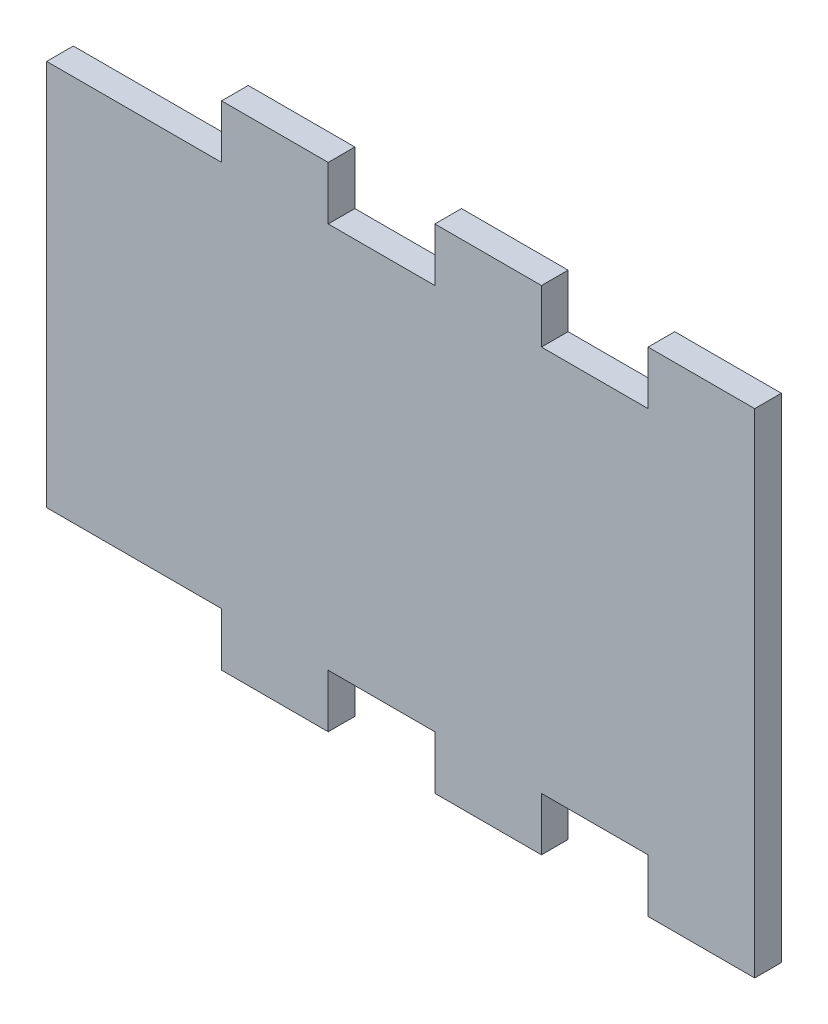
ISO-10303-21;
HEADER;
FILE_DESCRIPTION(('STEP AP214'),'2;1');
FILE_NAME('part.step','',(''),(''),'','','');
FILE_SCHEMA(('AUTOMOTIVE_DESIGN { 1 0 10303 214 1 1 1 1 }'));
ENDSEC;
DATA;
#1=APPLICATION_CONTEXT('core data for automotive mechanical design processes');
#2=APPLICATION_PROTOCOL_DEFINITION('international standard','automotive_design',2000,#1);
#3=PRODUCT_CONTEXT('',#1,'mechanical');
#4=PRODUCT('Part','Part','',(#3));
#5=PRODUCT_RELATED_PRODUCT_CATEGORY('part','',(#4));
#6=PRODUCT_DEFINITION_FORMATION('','',#4);
#7=PRODUCT_DEFINITION_CONTEXT('part definition',#1,'design');
#8=PRODUCT_DEFINITION('design','',#6,#7);
#9=PRODUCT_DEFINITION_SHAPE('','',#8);
#10=(LENGTH_UNIT() NAMED_UNIT(*) SI_UNIT(.MILLI.,.METRE.));
#11=(NAMED_UNIT(*) PLANE_ANGLE_UNIT() SI_UNIT($,.RADIAN.));
#12=(NAMED_UNIT(*) SI_UNIT($,.STERADIAN.) SOLID_ANGLE_UNIT());
#13=UNCERTAINTY_MEASURE_WITH_UNIT(LENGTH_MEASURE(1.E-05),#10,'distance_accuracy_value','');
#14=(GEOMETRIC_REPRESENTATION_CONTEXT(3) GLOBAL_UNCERTAINTY_ASSIGNED_CONTEXT((#13)) GLOBAL_UNIT_ASSIGNED_CONTEXT((#10,
#11,#12)) REPRESENTATION_CONTEXT('',''));
#15=CARTESIAN_POINT('',(0.,0.,0.));
#16=DIRECTION('',(0.,0.,1.));
#17=DIRECTION('',(1.,0.,0.));
#18=AXIS2_PLACEMENT_3D('',#15,#16,#17);
#19=CARTESIAN_POINT('',(0.,46.03496,3.175));
#20=DIRECTION('',(-1.,0.,0.));
#21=DIRECTION('',(0.,0.,1.));
#22=AXIS2_PLACEMENT_3D('',#19,#20,#21);
#23=PLANE('',#22);
#24=DIRECTION('',(0.,1.,0.));
#25=VECTOR('',#24,1.);
#26=CARTESIAN_POINT('',(0.,46.03496,0.));
#27=LINE('',#26,#25);
#28=CARTESIAN_POINT('',(0.,-6.35,0.));
#29=VERTEX_POINT('',#28);
#30=CARTESIAN_POINT('',(0.,52.38496,0.));
#31=VERTEX_POINT('',#30);
#32=EDGE_CURVE('E133',#29,#31,#27,.T.);
#33=ORIENTED_EDGE('',*,*,#32,.T.);
#34=DIRECTION('',(0.,0.,-1.));
#35=VECTOR('',#34,1.);
#36=CARTESIAN_POINT('',(0.,52.38496,3.175));
#37=LINE('',#36,#35);
#38=CARTESIAN_POINT('',(0.,52.38496,3.175));
#39=VERTEX_POINT('',#38);
#40=EDGE_CURVE('E11',#39,#31,#37,.T.);
#41=ORIENTED_EDGE('',*,*,#40,.F.);
#42=DIRECTION('',(0.,1.,0.));
#43=VECTOR('',#42,1.);
#44=CARTESIAN_POINT('',(0.,0.,3.175));
#45=LINE('',#44,#43);
#46=CARTESIAN_POINT('',(0.,-6.35,3.175));
#47=VERTEX_POINT('',#46);
#48=EDGE_CURVE('E139',#47,#39,#45,.T.);
#49=ORIENTED_EDGE('',*,*,#48,.F.);
#50=DIRECTION('',(0.,0.,-1.));
#51=VECTOR('',#50,1.);
#52=CARTESIAN_POINT('',(0.,-6.35,3.175));
#53=LINE('',#52,#51);
#54=EDGE_CURVE('E221',#47,#29,#53,.T.);
#55=ORIENTED_EDGE('',*,*,#54,.T.);
#56=EDGE_LOOP('',(#33,#41,#49,#55));
#57=FACE_BOUND('',#56,.T.);
#58=ADVANCED_FACE('F33',(#57),#23,.F.);
#59=CARTESIAN_POINT('',(0.,52.38496,3.175));
#60=DIRECTION('',(0.,-1.,0.));
#61=DIRECTION('',(0.,0.,-1.));
#62=AXIS2_PLACEMENT_3D('',#59,#60,#61);
#63=PLANE('',#62);
#64=DIRECTION('',(-1.,0.,0.));
#65=VECTOR('',#64,1.);
#66=CARTESIAN_POINT('',(0.,52.38496,0.));
#67=LINE('',#66,#65);
#68=CARTESIAN_POINT('',(-12.7,52.38496,0.));
#69=VERTEX_POINT('',#68);
#70=EDGE_CURVE('E226',#31,#69,#67,.T.);
#71=ORIENTED_EDGE('',*,*,#70,.T.);
#72=DIRECTION('',(0.,0.,-1.));
#73=VECTOR('',#72,1.);
#74=CARTESIAN_POINT('',(-12.7,52.38496,3.175));
#75=LINE('',#74,#73);
#76=CARTESIAN_POINT('',(-12.7,52.38496,3.175));
#77=VERTEX_POINT('',#76);
#78=EDGE_CURVE('E41',#77,#69,#75,.T.);
#79=ORIENTED_EDGE('',*,*,#78,.F.);
#80=DIRECTION('',(-1.,0.,0.));
#81=VECTOR('',#80,1.);
#82=CARTESIAN_POINT('',(0.,52.38496,3.175));
#83=LINE('',#82,#81);
#84=EDGE_CURVE('E400',#39,#77,#83,.T.);
#85=ORIENTED_EDGE('',*,*,#84,.F.);
#86=ORIENTED_EDGE('',*,*,#40,.T.);
#87=EDGE_LOOP('',(#71,#79,#85,#86));
#88=FACE_BOUND('',#87,.T.);
#89=ADVANCED_FACE('F403',(#88),#63,.F.);
#90=CARTESIAN_POINT('',(-12.7,46.03496,3.175));
#91=DIRECTION('',(1.,0.,0.));
#92=DIRECTION('',(0.,0.,-1.));
#93=AXIS2_PLACEMENT_3D('',#90,#91,#92);
#94=PLANE('',#93);
#95=DIRECTION('',(0.,-1.,0.));
#96=VECTOR('',#95,1.);
#97=CARTESIAN_POINT('',(-12.7,46.03496,0.));
#98=LINE('',#97,#96);
#99=CARTESIAN_POINT('',(-12.7,46.03496,0.));
#100=VERTEX_POINT('',#99);
#101=EDGE_CURVE('E228',#69,#100,#98,.T.);
#102=ORIENTED_EDGE('',*,*,#101,.T.);
#103=DIRECTION('',(0.,0.,-1.));
#104=VECTOR('',#103,1.);
#105=CARTESIAN_POINT('',(-12.7,46.03496,3.175));
#106=LINE('',#105,#104);
#107=CARTESIAN_POINT('',(-12.7,46.03496,3.175));
#108=VERTEX_POINT('',#107);
#109=EDGE_CURVE('E327',#108,#100,#106,.T.);
#110=ORIENTED_EDGE('',*,*,#109,.F.);
#111=DIRECTION('',(0.,-1.,0.));
#112=VECTOR('',#111,1.);
#113=CARTESIAN_POINT('',(-12.7,46.03496,3.175));
#114=LINE('',#113,#112);
#115=EDGE_CURVE('E336',#77,#108,#114,.T.);
#116=ORIENTED_EDGE('',*,*,#115,.F.);
#117=ORIENTED_EDGE('',*,*,#78,.T.);
#118=EDGE_LOOP('',(#102,#110,#116,#117));
#119=FACE_BOUND('',#118,.T.);
#120=ADVANCED_FACE('F334',(#119),#94,.F.);
#121=CARTESIAN_POINT('',(-12.7,46.03496,3.175));
#122=DIRECTION('',(0.,-1.,0.));
#123=DIRECTION('',(1.,0.,0.));
#124=AXIS2_PLACEMENT_3D('',#121,#122,#123);
#125=PLANE('',#124);
#126=DIRECTION('',(-1.,0.,0.));
#127=VECTOR('',#126,1.);
#128=CARTESIAN_POINT('',(-12.7,46.03496,0.));
#129=LINE('',#128,#127);
#130=CARTESIAN_POINT('',(-25.4,46.0349599999998,0.));
#131=VERTEX_POINT('',#130);
#132=EDGE_CURVE('E230',#100,#131,#129,.T.);
#133=ORIENTED_EDGE('',*,*,#132,.T.);
#134=DIRECTION('',(0.,0.,-1.));
#135=VECTOR('',#134,1.);
#136=CARTESIAN_POINT('',(-25.4,46.0349599999998,3.175));
#137=LINE('',#136,#135);
#138=CARTESIAN_POINT('',(-25.4,46.0349599999998,3.175));
#139=VERTEX_POINT('',#138);
#140=EDGE_CURVE('E324',#139,#131,#137,.T.);
#141=ORIENTED_EDGE('',*,*,#140,.F.);
#142=DIRECTION('',(-1.,0.,0.));
#143=VECTOR('',#142,1.);
#144=CARTESIAN_POINT('',(-12.7,46.03496,3.175));
#145=LINE('',#144,#143);
#146=EDGE_CURVE('E354',#108,#139,#145,.T.);
#147=ORIENTED_EDGE('',*,*,#146,.F.);
#148=ORIENTED_EDGE('',*,*,#109,.T.);
#149=EDGE_LOOP('',(#133,#141,#147,#148));
#150=FACE_BOUND('',#149,.T.);
#151=ADVANCED_FACE('F345',(#150),#125,.F.);
#152=CARTESIAN_POINT('',(-25.4,46.0349599999998,3.175));
#153=DIRECTION('',(-1.,0.,0.));
#154=DIRECTION('',(0.,0.,1.));
#155=AXIS2_PLACEMENT_3D('',#152,#153,#154);
#156=PLANE('',#155);
#157=DIRECTION('',(0.,1.,0.));
#158=VECTOR('',#157,1.);
#159=CARTESIAN_POINT('',(-25.4,46.0349599999998,0.));
#160=LINE('',#159,#158);
#161=CARTESIAN_POINT('',(-25.4,52.3849599999998,0.));
#162=VERTEX_POINT('',#161);
#163=EDGE_CURVE('E232',#131,#162,#160,.T.);
#164=ORIENTED_EDGE('',*,*,#163,.T.);
#165=DIRECTION('',(0.,0.,-1.));
#166=VECTOR('',#165,1.);
#167=CARTESIAN_POINT('',(-25.4,52.3849599999998,3.175));
#168=LINE('',#167,#166);
#169=CARTESIAN_POINT('',(-25.4,52.3849599999998,3.175));
#170=VERTEX_POINT('',#169);
#171=EDGE_CURVE('E321',#170,#162,#168,.T.);
#172=ORIENTED_EDGE('',*,*,#171,.F.);
#173=DIRECTION('',(0.,1.,0.));
#174=VECTOR('',#173,1.);
#175=CARTESIAN_POINT('',(-25.4,46.0349599999998,3.175));
#176=LINE('',#175,#174);
#177=EDGE_CURVE('E351',#139,#170,#176,.T.);
#178=ORIENTED_EDGE('',*,*,#177,.F.);
#179=ORIENTED_EDGE('',*,*,#140,.T.);
#180=EDGE_LOOP('',(#164,#172,#178,#179));
#181=FACE_BOUND('',#180,.T.);
#182=ADVANCED_FACE('F349',(#181),#156,.F.);
#183=CARTESIAN_POINT('',(-25.4,52.3849599999998,3.175));
#184=DIRECTION('',(0.,-1.,0.));
#185=DIRECTION('',(0.,0.,-1.));
#186=AXIS2_PLACEMENT_3D('',#183,#184,#185);
#187=PLANE('',#186);
#188=DIRECTION('',(-1.,0.,0.));
#189=VECTOR('',#188,1.);
#190=CARTESIAN_POINT('',(-25.4,52.3849599999998,0.));
#191=LINE('',#190,#189);
#192=CARTESIAN_POINT('',(-38.1,52.3849599999998,0.));
#193=VERTEX_POINT('',#192);
#194=EDGE_CURVE('E234',#162,#193,#191,.T.);
#195=ORIENTED_EDGE('',*,*,#194,.T.);
#196=DIRECTION('',(0.,0.,-1.));
#197=VECTOR('',#196,1.);
#198=CARTESIAN_POINT('',(-38.1,52.3849599999998,3.175));
#199=LINE('',#198,#197);
#200=CARTESIAN_POINT('',(-38.1,52.3849599999998,3.175));
#201=VERTEX_POINT('',#200);
#202=EDGE_CURVE('E318',#201,#193,#199,.T.);
#203=ORIENTED_EDGE('',*,*,#202,.F.);
#204=DIRECTION('',(-1.,0.,0.));
#205=VECTOR('',#204,1.);
#206=CARTESIAN_POINT('',(-25.4,52.3849599999998,3.175));
#207=LINE('',#206,#205);
#208=EDGE_CURVE('E353',#170,#201,#207,.T.);
#209=ORIENTED_EDGE('',*,*,#208,.F.);
#210=ORIENTED_EDGE('',*,*,#171,.T.);
#211=EDGE_LOOP('',(#195,#203,#209,#210));
#212=FACE_BOUND('',#211,.T.);
#213=ADVANCED_FACE('F415',(#212),#187,.F.);
#214=CARTESIAN_POINT('',(-38.1,46.0349599999998,3.175));
#215=DIRECTION('',(1.,0.,0.));
#216=DIRECTION('',(0.,0.,-1.));
#217=AXIS2_PLACEMENT_3D('',#214,#215,#216);
#218=PLANE('',#217);
#219=DIRECTION('',(0.,-1.,0.));
#220=VECTOR('',#219,1.);
#221=CARTESIAN_POINT('',(-38.1,46.0349599999998,0.));
#222=LINE('',#221,#220);
#223=CARTESIAN_POINT('',(-38.1,46.0349599999998,0.));
#224=VERTEX_POINT('',#223);
#225=EDGE_CURVE('E236',#193,#224,#222,.T.);
#226=ORIENTED_EDGE('',*,*,#225,.T.);
#227=DIRECTION('',(0.,0.,-1.));
#228=VECTOR('',#227,1.);
#229=CARTESIAN_POINT('',(-38.1,46.0349599999998,3.175));
#230=LINE('',#229,#228);
#231=CARTESIAN_POINT('',(-38.1,46.0349599999998,3.175));
#232=VERTEX_POINT('',#231);
#233=EDGE_CURVE('E315',#232,#224,#230,.T.);
#234=ORIENTED_EDGE('',*,*,#233,.F.);
#235=DIRECTION('',(0.,-1.,0.));
#236=VECTOR('',#235,1.);
#237=CARTESIAN_POINT('',(-38.1,46.0349599999998,3.175));
#238=LINE('',#237,#236);
#239=EDGE_CURVE('E356',#201,#232,#238,.T.);
#240=ORIENTED_EDGE('',*,*,#239,.F.);
#241=ORIENTED_EDGE('',*,*,#202,.T.);
#242=EDGE_LOOP('',(#226,#234,#240,#241));
#243=FACE_BOUND('',#242,.T.);
#244=ADVANCED_FACE('F418',(#243),#218,.F.);
#245=CARTESIAN_POINT('',(-38.1,46.0349599999998,3.175));
#246=DIRECTION('',(0.,-1.,0.));
#247=DIRECTION('',(1.,0.,0.));
#248=AXIS2_PLACEMENT_3D('',#245,#246,#247);
#249=PLANE('',#248);
#250=DIRECTION('',(-1.,0.,0.));
#251=VECTOR('',#250,1.);
#252=CARTESIAN_POINT('',(-38.1,46.0349599999998,0.));
#253=LINE('',#252,#251);
#254=CARTESIAN_POINT('',(-50.8,46.0349599999996,0.));
#255=VERTEX_POINT('',#254);
#256=EDGE_CURVE('E238',#224,#255,#253,.T.);
#257=ORIENTED_EDGE('',*,*,#256,.T.);
#258=DIRECTION('',(0.,0.,-1.));
#259=VECTOR('',#258,1.);
#260=CARTESIAN_POINT('',(-50.8,46.0349599999996,3.175));
#261=LINE('',#260,#259);
#262=CARTESIAN_POINT('',(-50.8,46.0349599999996,3.175));
#263=VERTEX_POINT('',#262);
#264=EDGE_CURVE('E312',#263,#255,#261,.T.);
#265=ORIENTED_EDGE('',*,*,#264,.F.);
#266=DIRECTION('',(-1.,0.,0.));
#267=VECTOR('',#266,1.);
#268=CARTESIAN_POINT('',(-38.1,46.0349599999998,3.175));
#269=LINE('',#268,#267);
#270=EDGE_CURVE('E362',#232,#263,#269,.T.);
#271=ORIENTED_EDGE('',*,*,#270,.F.);
#272=ORIENTED_EDGE('',*,*,#233,.T.);
#273=EDGE_LOOP('',(#257,#265,#271,#272));
#274=FACE_BOUND('',#273,.T.);
#275=ADVANCED_FACE('F422',(#274),#249,.F.);
#276=CARTESIAN_POINT('',(-50.8,46.0349599999996,3.175));
#277=DIRECTION('',(-1.,0.,0.));
#278=DIRECTION('',(0.,0.,1.));
#279=AXIS2_PLACEMENT_3D('',#276,#277,#278);
#280=PLANE('',#279);
#281=DIRECTION('',(0.,1.,0.));
#282=VECTOR('',#281,1.);
#283=CARTESIAN_POINT('',(-50.8,46.0349599999996,0.));
#284=LINE('',#283,#282);
#285=CARTESIAN_POINT('',(-50.8,52.3849599999996,0.));
#286=VERTEX_POINT('',#285);
#287=EDGE_CURVE('E240',#255,#286,#284,.T.);
#288=ORIENTED_EDGE('',*,*,#287,.T.);
#289=DIRECTION('',(0.,0.,-1.));
#290=VECTOR('',#289,1.);
#291=CARTESIAN_POINT('',(-50.8,52.3849599999996,3.175));
#292=LINE('',#291,#290);
#293=CARTESIAN_POINT('',(-50.8,52.3849599999996,3.175));
#294=VERTEX_POINT('',#293);
#295=EDGE_CURVE('E309',#294,#286,#292,.T.);
#296=ORIENTED_EDGE('',*,*,#295,.F.);
#297=DIRECTION('',(0.,1.,0.));
#298=VECTOR('',#297,1.);
#299=CARTESIAN_POINT('',(-50.8,46.0349599999996,3.175));
#300=LINE('',#299,#298);
#301=EDGE_CURVE('E364',#263,#294,#300,.T.);
#302=ORIENTED_EDGE('',*,*,#301,.F.);
#303=ORIENTED_EDGE('',*,*,#264,.T.);
#304=EDGE_LOOP('',(#288,#296,#302,#303));
#305=FACE_BOUND('',#304,.T.);
#306=ADVANCED_FACE('F426',(#305),#280,.F.);
#307=CARTESIAN_POINT('',(-50.8,52.3849599999996,3.175));
#308=DIRECTION('',(0.,-1.,0.));
#309=DIRECTION('',(0.,0.,-1.));
#310=AXIS2_PLACEMENT_3D('',#307,#308,#309);
#311=PLANE('',#310);
#312=DIRECTION('',(-1.,0.,0.));
#313=VECTOR('',#312,1.);
#314=CARTESIAN_POINT('',(-50.8,52.3849599999996,0.));
#315=LINE('',#314,#313);
#316=CARTESIAN_POINT('',(-63.5,52.3849599999996,0.));
#317=VERTEX_POINT('',#316);
#318=EDGE_CURVE('E242',#286,#317,#315,.T.);
#319=ORIENTED_EDGE('',*,*,#318,.T.);
#320=DIRECTION('',(0.,0.,-1.));
#321=VECTOR('',#320,1.);
#322=CARTESIAN_POINT('',(-63.5,52.3849599999996,3.175));
#323=LINE('',#322,#321);
#324=CARTESIAN_POINT('',(-63.5,52.3849599999996,3.175));
#325=VERTEX_POINT('',#324);
#326=EDGE_CURVE('E306',#325,#317,#323,.T.);
#327=ORIENTED_EDGE('',*,*,#326,.F.);
#328=DIRECTION('',(-1.,0.,0.));
#329=VECTOR('',#328,1.);
#330=CARTESIAN_POINT('',(-50.8,52.3849599999996,3.175));
#331=LINE('',#330,#329);
#332=EDGE_CURVE('E366',#294,#325,#331,.T.);
#333=ORIENTED_EDGE('',*,*,#332,.F.);
#334=ORIENTED_EDGE('',*,*,#295,.T.);
#335=EDGE_LOOP('',(#319,#327,#333,#334));
#336=FACE_BOUND('',#335,.T.);
#337=ADVANCED_FACE('F430',(#336),#311,.F.);
#338=CARTESIAN_POINT('',(-63.5,46.0349599999996,3.175));
#339=DIRECTION('',(1.,0.,0.));
#340=DIRECTION('',(0.,0.,-1.));
#341=AXIS2_PLACEMENT_3D('',#338,#339,#340);
#342=PLANE('',#341);
#343=DIRECTION('',(0.,-1.,0.));
#344=VECTOR('',#343,1.);
#345=CARTESIAN_POINT('',(-63.5,46.0349599999996,0.));
#346=LINE('',#345,#344);
#347=CARTESIAN_POINT('',(-63.5,46.0349599999996,0.));
#348=VERTEX_POINT('',#347);
#349=EDGE_CURVE('E244',#317,#348,#346,.T.);
#350=ORIENTED_EDGE('',*,*,#349,.T.);
#351=DIRECTION('',(0.,0.,-1.));
#352=VECTOR('',#351,1.);
#353=CARTESIAN_POINT('',(-63.5,46.0349599999996,3.175));
#354=LINE('',#353,#352);
#355=CARTESIAN_POINT('',(-63.5,46.0349599999996,3.175));
#356=VERTEX_POINT('',#355);
#357=EDGE_CURVE('E303',#356,#348,#354,.T.);
#358=ORIENTED_EDGE('',*,*,#357,.F.);
#359=DIRECTION('',(0.,-1.,0.));
#360=VECTOR('',#359,1.);
#361=CARTESIAN_POINT('',(-63.5,46.0349599999996,3.175));
#362=LINE('',#361,#360);
#363=EDGE_CURVE('E368',#325,#356,#362,.T.);
#364=ORIENTED_EDGE('',*,*,#363,.F.);
#365=ORIENTED_EDGE('',*,*,#326,.T.);
#366=EDGE_LOOP('',(#350,#358,#364,#365));
#367=FACE_BOUND('',#366,.T.);
#368=ADVANCED_FACE('F434',(#367),#342,.F.);
#369=CARTESIAN_POINT('',(-76.2,46.0349599999995,3.175));
#370=DIRECTION('',(0.,-1.,0.));
#371=DIRECTION('',(1.,0.,0.));
#372=AXIS2_PLACEMENT_3D('',#369,#370,#371);
#373=PLANE('',#372);
#374=DIRECTION('',(-1.,0.,0.));
#375=VECTOR('',#374,1.);
#376=CARTESIAN_POINT('',(-76.2,46.0349599999995,0.));
#377=LINE('',#376,#375);
#378=CARTESIAN_POINT('',(-84.33816,46.03496,0.));
#379=VERTEX_POINT('',#378);
#380=EDGE_CURVE('E247',#348,#379,#377,.T.);
#381=ORIENTED_EDGE('',*,*,#380,.T.);
#382=DIRECTION('',(0.,0.,-1.));
#383=VECTOR('',#382,1.);
#384=CARTESIAN_POINT('',(-84.33816,46.03496,3.175));
#385=LINE('',#384,#383);
#386=CARTESIAN_POINT('',(-84.33816,46.03496,3.175));
#387=VERTEX_POINT('',#386);
#388=EDGE_CURVE('E300',#387,#379,#385,.T.);
#389=ORIENTED_EDGE('',*,*,#388,.F.);
#390=DIRECTION('',(-1.,0.,0.));
#391=VECTOR('',#390,1.);
#392=CARTESIAN_POINT('',(-63.5,46.0349599999996,3.175));
#393=LINE('',#392,#391);
#394=EDGE_CURVE('E370',#356,#387,#393,.T.);
#395=ORIENTED_EDGE('',*,*,#394,.F.);
#396=ORIENTED_EDGE('',*,*,#357,.T.);
#397=EDGE_LOOP('',(#381,#389,#395,#396));
#398=FACE_BOUND('',#397,.T.);
#399=ADVANCED_FACE('F438',(#398),#373,.F.);
#400=CARTESIAN_POINT('',(-84.33816,0.,3.175));
#401=DIRECTION('',(1.,0.,0.));
#402=DIRECTION('',(0.,0.,-1.));
#403=AXIS2_PLACEMENT_3D('',#400,#401,#402);
#404=PLANE('',#403);
#405=DIRECTION('',(0.,-1.,0.));
#406=VECTOR('',#405,1.);
#407=CARTESIAN_POINT('',(-84.33816,0.,0.));
#408=LINE('',#407,#406);
#409=CARTESIAN_POINT('',(-84.33816,0.,0.));
#410=VERTEX_POINT('',#409);
#411=EDGE_CURVE('E249',#379,#410,#408,.T.);
#412=ORIENTED_EDGE('',*,*,#411,.T.);
#413=DIRECTION('',(0.,0.,-1.));
#414=VECTOR('',#413,1.);
#415=CARTESIAN_POINT('',(-84.33816,0.,3.175));
#416=LINE('',#415,#414);
#417=CARTESIAN_POINT('',(-84.33816,0.,3.175));
#418=VERTEX_POINT('',#417);
#419=EDGE_CURVE('E297',#418,#410,#416,.T.);
#420=ORIENTED_EDGE('',*,*,#419,.F.);
#421=DIRECTION('',(0.,-1.,0.));
#422=VECTOR('',#421,1.);
#423=CARTESIAN_POINT('',(-84.33816,0.,3.175));
#424=LINE('',#423,#422);
#425=EDGE_CURVE('E372',#387,#418,#424,.T.);
#426=ORIENTED_EDGE('',*,*,#425,.F.);
#427=ORIENTED_EDGE('',*,*,#388,.T.);
#428=EDGE_LOOP('',(#412,#420,#426,#427));
#429=FACE_BOUND('',#428,.T.);
#430=ADVANCED_FACE('F442',(#429),#404,.F.);
#431=CARTESIAN_POINT('',(-63.5,3.33066907387547E-13,3.175));
#432=DIRECTION('',(0.,1.,0.));
#433=DIRECTION('',(-1.,0.,0.));
#434=AXIS2_PLACEMENT_3D('',#431,#432,#433);
#435=PLANE('',#434);
#436=DIRECTION('',(1.,0.,0.));
#437=VECTOR('',#436,1.);
#438=CARTESIAN_POINT('',(-63.5,3.33066907387547E-13,0.));
#439=LINE('',#438,#437);
#440=CARTESIAN_POINT('',(-63.5,3.33066907387547E-13,0.));
#441=VERTEX_POINT('',#440);
#442=EDGE_CURVE('E252',#410,#441,#439,.T.);
#443=ORIENTED_EDGE('',*,*,#442,.T.);
#444=DIRECTION('',(0.,0.,-1.));
#445=VECTOR('',#444,1.);
#446=CARTESIAN_POINT('',(-63.5,3.33066907387547E-13,3.175));
#447=LINE('',#446,#445);
#448=CARTESIAN_POINT('',(-63.5,3.33066907387547E-13,3.175));
#449=VERTEX_POINT('',#448);
#450=EDGE_CURVE('E294',#449,#441,#447,.T.);
#451=ORIENTED_EDGE('',*,*,#450,.F.);
#452=DIRECTION('',(1.,0.,0.));
#453=VECTOR('',#452,1.);
#454=CARTESIAN_POINT('',(-76.2,5.06539254985228E-13,3.175));
#455=LINE('',#454,#453);
#456=EDGE_CURVE('E374',#418,#449,#455,.T.);
#457=ORIENTED_EDGE('',*,*,#456,.F.);
#458=ORIENTED_EDGE('',*,*,#419,.T.);
#459=EDGE_LOOP('',(#443,#451,#457,#458));
#460=FACE_BOUND('',#459,.T.);
#461=ADVANCED_FACE('F446',(#460),#435,.F.);
#462=CARTESIAN_POINT('',(-63.5,3.33066907387547E-13,3.175));
#463=DIRECTION('',(1.,0.,0.));
#464=DIRECTION('',(0.,0.,-1.));
#465=AXIS2_PLACEMENT_3D('',#462,#463,#464);
#466=PLANE('',#465);
#467=DIRECTION('',(0.,-1.,0.));
#468=VECTOR('',#467,1.);
#469=CARTESIAN_POINT('',(-63.5,3.33066907387547E-13,0.));
#470=LINE('',#469,#468);
#471=CARTESIAN_POINT('',(-63.5,-6.34999999999967,0.));
#472=VERTEX_POINT('',#471);
#473=EDGE_CURVE('E254',#441,#472,#470,.T.);
#474=ORIENTED_EDGE('',*,*,#473,.T.);
#475=DIRECTION('',(0.,0.,-1.));
#476=VECTOR('',#475,1.);
#477=CARTESIAN_POINT('',(-63.5,-6.34999999999967,3.175));
#478=LINE('',#477,#476);
#479=CARTESIAN_POINT('',(-63.5,-6.34999999999967,3.175));
#480=VERTEX_POINT('',#479);
#481=EDGE_CURVE('E291',#480,#472,#478,.T.);
#482=ORIENTED_EDGE('',*,*,#481,.F.);
#483=DIRECTION('',(0.,-1.,0.));
#484=VECTOR('',#483,1.);
#485=CARTESIAN_POINT('',(-63.5,3.33066907387547E-13,3.175));
#486=LINE('',#485,#484);
#487=EDGE_CURVE('E376',#449,#480,#486,.T.);
#488=ORIENTED_EDGE('',*,*,#487,.F.);
#489=ORIENTED_EDGE('',*,*,#450,.T.);
#490=EDGE_LOOP('',(#474,#482,#488,#489));
#491=FACE_BOUND('',#490,.T.);
#492=ADVANCED_FACE('F450',(#491),#466,.F.);
#493=CARTESIAN_POINT('',(-50.8,-6.34999999999966,3.175));
#494=DIRECTION('',(0.,1.,0.));
#495=DIRECTION('',(-1.,0.,0.));
#496=AXIS2_PLACEMENT_3D('',#493,#494,#495);
#497=PLANE('',#496);
#498=DIRECTION('',(1.,0.,0.));
#499=VECTOR('',#498,1.);
#500=CARTESIAN_POINT('',(-50.8,-6.34999999999966,0.));
#501=LINE('',#500,#499);
#502=CARTESIAN_POINT('',(-50.8,-6.34999999999966,0.));
#503=VERTEX_POINT('',#502);
#504=EDGE_CURVE('E256',#472,#503,#501,.T.);
#505=ORIENTED_EDGE('',*,*,#504,.T.);
#506=DIRECTION('',(0.,0.,-1.));
#507=VECTOR('',#506,1.);
#508=CARTESIAN_POINT('',(-50.8,-6.34999999999966,3.175));
#509=LINE('',#508,#507);
#510=CARTESIAN_POINT('',(-50.8,-6.34999999999966,3.175));
#511=VERTEX_POINT('',#510);
#512=EDGE_CURVE('E288',#511,#503,#509,.T.);
#513=ORIENTED_EDGE('',*,*,#512,.F.);
#514=DIRECTION('',(1.,0.,0.));
#515=VECTOR('',#514,1.);
#516=CARTESIAN_POINT('',(-50.8,-6.34999999999966,3.175));
#517=LINE('',#516,#515);
#518=EDGE_CURVE('E378',#480,#511,#517,.T.);
#519=ORIENTED_EDGE('',*,*,#518,.F.);
#520=ORIENTED_EDGE('',*,*,#481,.T.);
#521=EDGE_LOOP('',(#505,#513,#519,#520));
#522=FACE_BOUND('',#521,.T.);
#523=ADVANCED_FACE('F454',(#522),#497,.F.);
#524=CARTESIAN_POINT('',(-50.8,3.40005801291454E-13,3.175));
#525=DIRECTION('',(-1.,0.,0.));
#526=DIRECTION('',(0.,0.,1.));
#527=AXIS2_PLACEMENT_3D('',#524,#525,#526);
#528=PLANE('',#527);
#529=DIRECTION('',(0.,1.,0.));
#530=VECTOR('',#529,1.);
#531=CARTESIAN_POINT('',(-50.8,3.40005801291454E-13,0.));
#532=LINE('',#531,#530);
#533=CARTESIAN_POINT('',(-50.8,3.40005801291454E-13,0.));
#534=VERTEX_POINT('',#533);
#535=EDGE_CURVE('E258',#503,#534,#532,.T.);
#536=ORIENTED_EDGE('',*,*,#535,.T.);
#537=DIRECTION('',(0.,0.,-1.));
#538=VECTOR('',#537,1.);
#539=CARTESIAN_POINT('',(-50.8,3.40005801291454E-13,3.175));
#540=LINE('',#539,#538);
#541=CARTESIAN_POINT('',(-50.8,3.40005801291454E-13,3.175));
#542=VERTEX_POINT('',#541);
#543=EDGE_CURVE('E285',#542,#534,#540,.T.);
#544=ORIENTED_EDGE('',*,*,#543,.F.);
#545=DIRECTION('',(0.,1.,0.));
#546=VECTOR('',#545,1.);
#547=CARTESIAN_POINT('',(-50.8,3.40005801291454E-13,3.175));
#548=LINE('',#547,#546);
#549=EDGE_CURVE('E380',#511,#542,#548,.T.);
#550=ORIENTED_EDGE('',*,*,#549,.F.);
#551=ORIENTED_EDGE('',*,*,#512,.T.);
#552=EDGE_LOOP('',(#536,#544,#550,#551));
#553=FACE_BOUND('',#552,.T.);
#554=ADVANCED_FACE('F458',(#553),#528,.F.);
#555=CARTESIAN_POINT('',(-38.1,1.66533453693773E-13,3.175));
#556=DIRECTION('',(0.,1.,0.));
#557=DIRECTION('',(-1.,0.,0.));
#558=AXIS2_PLACEMENT_3D('',#555,#556,#557);
#559=PLANE('',#558);
#560=DIRECTION('',(1.,0.,0.));
#561=VECTOR('',#560,1.);
#562=CARTESIAN_POINT('',(-38.1,1.66533453693773E-13,0.));
#563=LINE('',#562,#561);
#564=CARTESIAN_POINT('',(-38.1,1.66533453693773E-13,0.));
#565=VERTEX_POINT('',#564);
#566=EDGE_CURVE('E260',#534,#565,#563,.T.);
#567=ORIENTED_EDGE('',*,*,#566,.T.);
#568=DIRECTION('',(0.,0.,-1.));
#569=VECTOR('',#568,1.);
#570=CARTESIAN_POINT('',(-38.1,1.66533453693773E-13,3.175));
#571=LINE('',#570,#569);
#572=CARTESIAN_POINT('',(-38.1,1.66533453693773E-13,3.175));
#573=VERTEX_POINT('',#572);
#574=EDGE_CURVE('E282',#573,#565,#571,.T.);
#575=ORIENTED_EDGE('',*,*,#574,.F.);
#576=DIRECTION('',(1.,0.,0.));
#577=VECTOR('',#576,1.);
#578=CARTESIAN_POINT('',(-38.1,1.66533453693773E-13,3.175));
#579=LINE('',#578,#577);
#580=EDGE_CURVE('E382',#542,#573,#579,.T.);
#581=ORIENTED_EDGE('',*,*,#580,.F.);
#582=ORIENTED_EDGE('',*,*,#543,.T.);
#583=EDGE_LOOP('',(#567,#575,#581,#582));
#584=FACE_BOUND('',#583,.T.);
#585=ADVANCED_FACE('F462',(#584),#559,.F.);
#586=CARTESIAN_POINT('',(-38.1,1.66533453693773E-13,3.175));
#587=DIRECTION('',(1.,0.,0.));
#588=DIRECTION('',(0.,0.,-1.));
#589=AXIS2_PLACEMENT_3D('',#586,#587,#588);
#590=PLANE('',#589);
#591=DIRECTION('',(0.,-1.,0.));
#592=VECTOR('',#591,1.);
#593=CARTESIAN_POINT('',(-38.1,1.66533453693773E-13,0.));
#594=LINE('',#593,#592);
#595=CARTESIAN_POINT('',(-38.1,-6.34999999999984,0.));
#596=VERTEX_POINT('',#595);
#597=EDGE_CURVE('E262',#565,#596,#594,.T.);
#598=ORIENTED_EDGE('',*,*,#597,.T.);
#599=DIRECTION('',(0.,0.,-1.));
#600=VECTOR('',#599,1.);
#601=CARTESIAN_POINT('',(-38.1,-6.34999999999984,3.175));
#602=LINE('',#601,#600);
#603=CARTESIAN_POINT('',(-38.1,-6.34999999999984,3.175));
#604=VERTEX_POINT('',#603);
#605=EDGE_CURVE('E279',#604,#596,#602,.T.);
#606=ORIENTED_EDGE('',*,*,#605,.F.);
#607=DIRECTION('',(0.,-1.,0.));
#608=VECTOR('',#607,1.);
#609=CARTESIAN_POINT('',(-38.1,1.66533453693773E-13,3.175));
#610=LINE('',#609,#608);
#611=EDGE_CURVE('E384',#573,#604,#610,.T.);
#612=ORIENTED_EDGE('',*,*,#611,.F.);
#613=ORIENTED_EDGE('',*,*,#574,.T.);
#614=EDGE_LOOP('',(#598,#606,#612,#613));
#615=FACE_BOUND('',#614,.T.);
#616=ADVANCED_FACE('F466',(#615),#590,.F.);
#617=CARTESIAN_POINT('',(-25.4,-6.34999999999983,3.175));
#618=DIRECTION('',(0.,1.,0.));
#619=DIRECTION('',(-1.,0.,0.));
#620=AXIS2_PLACEMENT_3D('',#617,#618,#619);
#621=PLANE('',#620);
#622=DIRECTION('',(1.,0.,0.));
#623=VECTOR('',#622,1.);
#624=CARTESIAN_POINT('',(-25.4,-6.34999999999983,0.));
#625=LINE('',#624,#623);
#626=CARTESIAN_POINT('',(-25.4,-6.34999999999983,0.));
#627=VERTEX_POINT('',#626);
#628=EDGE_CURVE('E264',#596,#627,#625,.T.);
#629=ORIENTED_EDGE('',*,*,#628,.T.);
#630=DIRECTION('',(0.,0.,-1.));
#631=VECTOR('',#630,1.);
#632=CARTESIAN_POINT('',(-25.4,-6.34999999999983,3.175));
#633=LINE('',#632,#631);
#634=CARTESIAN_POINT('',(-25.4,-6.34999999999983,3.175));
#635=VERTEX_POINT('',#634);
#636=EDGE_CURVE('E276',#635,#627,#633,.T.);
#637=ORIENTED_EDGE('',*,*,#636,.F.);
#638=DIRECTION('',(1.,0.,0.));
#639=VECTOR('',#638,1.);
#640=CARTESIAN_POINT('',(-25.4,-6.34999999999983,3.175));
#641=LINE('',#640,#639);
#642=EDGE_CURVE('E386',#604,#635,#641,.T.);
#643=ORIENTED_EDGE('',*,*,#642,.F.);
#644=ORIENTED_EDGE('',*,*,#605,.T.);
#645=EDGE_LOOP('',(#629,#637,#643,#644));
#646=FACE_BOUND('',#645,.T.);
#647=ADVANCED_FACE('F392',(#646),#621,.F.);
#648=CARTESIAN_POINT('',(-25.4,1.73472347597681E-13,3.175));
#649=DIRECTION('',(-1.,0.,0.));
#650=DIRECTION('',(0.,0.,1.));
#651=AXIS2_PLACEMENT_3D('',#648,#649,#650);
#652=PLANE('',#651);
#653=DIRECTION('',(0.,1.,0.));
#654=VECTOR('',#653,1.);
#655=CARTESIAN_POINT('',(-25.4,1.73472347597681E-13,0.));
#656=LINE('',#655,#654);
#657=CARTESIAN_POINT('',(-25.4,1.73472347597681E-13,0.));
#658=VERTEX_POINT('',#657);
#659=EDGE_CURVE('E266',#627,#658,#656,.T.);
#660=ORIENTED_EDGE('',*,*,#659,.T.);
#661=DIRECTION('',(0.,0.,-1.));
#662=VECTOR('',#661,1.);
#663=CARTESIAN_POINT('',(-25.4,1.73472347597681E-13,3.175));
#664=LINE('',#663,#662);
#665=CARTESIAN_POINT('',(-25.4,1.73472347597681E-13,3.175));
#666=VERTEX_POINT('',#665);
#667=EDGE_CURVE('E216',#666,#658,#664,.T.);
#668=ORIENTED_EDGE('',*,*,#667,.F.);
#669=DIRECTION('',(0.,1.,0.));
#670=VECTOR('',#669,1.);
#671=CARTESIAN_POINT('',(-25.4,1.73472347597681E-13,3.175));
#672=LINE('',#671,#670);
#673=EDGE_CURVE('E207',#635,#666,#672,.T.);
#674=ORIENTED_EDGE('',*,*,#673,.F.);
#675=ORIENTED_EDGE('',*,*,#636,.T.);
#676=EDGE_LOOP('',(#660,#668,#674,#675));
#677=FACE_BOUND('',#676,.T.);
#678=ADVANCED_FACE('F396',(#677),#652,.F.);
#679=CARTESIAN_POINT('',(-12.7,0.,3.175));
#680=DIRECTION('',(0.,1.,0.));
#681=DIRECTION('',(-1.,0.,0.));
#682=AXIS2_PLACEMENT_3D('',#679,#680,#681);
#683=PLANE('',#682);
#684=DIRECTION('',(1.,0.,0.));
#685=VECTOR('',#684,1.);
#686=CARTESIAN_POINT('',(-12.7,0.,0.));
#687=LINE('',#686,#685);
#688=CARTESIAN_POINT('',(-12.7,0.,0.));
#689=VERTEX_POINT('',#688);
#690=EDGE_CURVE('E215',#658,#689,#687,.T.);
#691=ORIENTED_EDGE('',*,*,#690,.T.);
#692=DIRECTION('',(0.,0.,-1.));
#693=VECTOR('',#692,1.);
#694=CARTESIAN_POINT('',(-12.7,0.,3.175));
#695=LINE('',#694,#693);
#696=CARTESIAN_POINT('',(-12.7,0.,3.175));
#697=VERTEX_POINT('',#696);
#698=EDGE_CURVE('E212',#697,#689,#695,.T.);
#699=ORIENTED_EDGE('',*,*,#698,.F.);
#700=DIRECTION('',(1.,0.,0.));
#701=VECTOR('',#700,1.);
#702=CARTESIAN_POINT('',(-12.7,0.,3.175));
#703=LINE('',#702,#701);
#704=EDGE_CURVE('E201',#666,#697,#703,.T.);
#705=ORIENTED_EDGE('',*,*,#704,.F.);
#706=ORIENTED_EDGE('',*,*,#667,.T.);
#707=EDGE_LOOP('',(#691,#699,#705,#706));
#708=FACE_BOUND('',#707,.T.);
#709=ADVANCED_FACE('F213',(#708),#683,.F.);
#710=CARTESIAN_POINT('',(-12.7,0.,3.175));
#711=DIRECTION('',(1.,0.,0.));
#712=DIRECTION('',(0.,0.,-1.));
#713=AXIS2_PLACEMENT_3D('',#710,#711,#712);
#714=PLANE('',#713);
#715=DIRECTION('',(0.,-1.,0.));
#716=VECTOR('',#715,1.);
#717=CARTESIAN_POINT('',(-12.7,0.,0.));
#718=LINE('',#717,#716);
#719=CARTESIAN_POINT('',(-12.7,-6.35000000000001,0.));
#720=VERTEX_POINT('',#719);
#721=EDGE_CURVE('E126',#689,#720,#718,.T.);
#722=ORIENTED_EDGE('',*,*,#721,.T.);
#723=DIRECTION('',(0.,0.,-1.));
#724=VECTOR('',#723,1.);
#725=CARTESIAN_POINT('',(-12.7,-6.35000000000001,3.175));
#726=LINE('',#725,#724);
#727=CARTESIAN_POINT('',(-12.7,-6.35000000000001,3.175));
#728=VERTEX_POINT('',#727);
#729=EDGE_CURVE('E217',#728,#720,#726,.T.);
#730=ORIENTED_EDGE('',*,*,#729,.F.);
#731=DIRECTION('',(0.,-1.,0.));
#732=VECTOR('',#731,1.);
#733=CARTESIAN_POINT('',(-12.7,0.,3.175));
#734=LINE('',#733,#732);
#735=EDGE_CURVE('E205',#697,#728,#734,.T.);
#736=ORIENTED_EDGE('',*,*,#735,.F.);
#737=ORIENTED_EDGE('',*,*,#698,.T.);
#738=EDGE_LOOP('',(#722,#730,#736,#737));
#739=FACE_BOUND('',#738,.T.);
#740=ADVANCED_FACE('F219',(#739),#714,.F.);
#741=CARTESIAN_POINT('',(0.,-6.35,3.175));
#742=DIRECTION('',(0.,1.,0.));
#743=DIRECTION('',(-1.,0.,0.));
#744=AXIS2_PLACEMENT_3D('',#741,#742,#743);
#745=PLANE('',#744);
#746=DIRECTION('',(1.,0.,0.));
#747=VECTOR('',#746,1.);
#748=CARTESIAN_POINT('',(0.,-6.35,0.));
#749=LINE('',#748,#747);
#750=EDGE_CURVE('E270',#720,#29,#749,.T.);
#751=ORIENTED_EDGE('',*,*,#750,.T.);
#752=ORIENTED_EDGE('',*,*,#54,.F.);
#753=DIRECTION('',(1.,0.,0.));
#754=VECTOR('',#753,1.);
#755=CARTESIAN_POINT('',(0.,-6.35,3.175));
#756=LINE('',#755,#754);
#757=EDGE_CURVE('E49',#728,#47,#756,.T.);
#758=ORIENTED_EDGE('',*,*,#757,.F.);
#759=ORIENTED_EDGE('',*,*,#729,.T.);
#760=EDGE_LOOP('',(#751,#752,#758,#759));
#761=FACE_BOUND('',#760,.T.);
#762=ADVANCED_FACE('F398',(#761),#745,.F.);
#763=CARTESIAN_POINT('',(0.,0.,3.175));
#764=DIRECTION('',(0.,0.,-1.));
#765=DIRECTION('',(-1.,0.,0.));
#766=AXIS2_PLACEMENT_3D('',#763,#764,#765);
#767=PLANE('',#766);
#768=ORIENTED_EDGE('',*,*,#48,.T.);
#769=ORIENTED_EDGE('',*,*,#84,.T.);
#770=ORIENTED_EDGE('',*,*,#115,.T.);
#771=ORIENTED_EDGE('',*,*,#146,.T.);
#772=ORIENTED_EDGE('',*,*,#177,.T.);
#773=ORIENTED_EDGE('',*,*,#208,.T.);
#774=ORIENTED_EDGE('',*,*,#239,.T.);
#775=ORIENTED_EDGE('',*,*,#270,.T.);
#776=ORIENTED_EDGE('',*,*,#301,.T.);
#777=ORIENTED_EDGE('',*,*,#332,.T.);
#778=ORIENTED_EDGE('',*,*,#363,.T.);
#779=ORIENTED_EDGE('',*,*,#394,.T.);
#780=ORIENTED_EDGE('',*,*,#425,.T.);
#781=ORIENTED_EDGE('',*,*,#456,.T.);
#782=ORIENTED_EDGE('',*,*,#487,.T.);
#783=ORIENTED_EDGE('',*,*,#518,.T.);
#784=ORIENTED_EDGE('',*,*,#549,.T.);
#785=ORIENTED_EDGE('',*,*,#580,.T.);
#786=ORIENTED_EDGE('',*,*,#611,.T.);
#787=ORIENTED_EDGE('',*,*,#642,.T.);
#788=ORIENTED_EDGE('',*,*,#673,.T.);
#789=ORIENTED_EDGE('',*,*,#704,.T.);
#790=ORIENTED_EDGE('',*,*,#735,.T.);
#791=ORIENTED_EDGE('',*,*,#757,.T.);
#792=EDGE_LOOP('',(#768,#769,#770,#771,#772,#773,#774,#775,#776,#777,#778,#779,#780,#781,#782,
#783,#784,#785,#786,#787,#788,#789,#790,#791));
#793=FACE_BOUND('',#792,.T.);
#794=ADVANCED_FACE('F203',(#793),#767,.F.);
#795=CARTESIAN_POINT('',(0.,0.,0.));
#796=DIRECTION('',(0.,0.,-1.));
#797=DIRECTION('',(-1.,0.,0.));
#798=AXIS2_PLACEMENT_3D('',#795,#796,#797);
#799=PLANE('',#798);
#800=ORIENTED_EDGE('',*,*,#32,.F.);
#801=ORIENTED_EDGE('',*,*,#750,.F.);
#802=ORIENTED_EDGE('',*,*,#721,.F.);
#803=ORIENTED_EDGE('',*,*,#690,.F.);
#804=ORIENTED_EDGE('',*,*,#659,.F.);
#805=ORIENTED_EDGE('',*,*,#628,.F.);
#806=ORIENTED_EDGE('',*,*,#597,.F.);
#807=ORIENTED_EDGE('',*,*,#566,.F.);
#808=ORIENTED_EDGE('',*,*,#535,.F.);
#809=ORIENTED_EDGE('',*,*,#504,.F.);
#810=ORIENTED_EDGE('',*,*,#473,.F.);
#811=ORIENTED_EDGE('',*,*,#442,.F.);
#812=ORIENTED_EDGE('',*,*,#411,.F.);
#813=ORIENTED_EDGE('',*,*,#380,.F.);
#814=ORIENTED_EDGE('',*,*,#349,.F.);
#815=ORIENTED_EDGE('',*,*,#318,.F.);
#816=ORIENTED_EDGE('',*,*,#287,.F.);
#817=ORIENTED_EDGE('',*,*,#256,.F.);
#818=ORIENTED_EDGE('',*,*,#225,.F.);
#819=ORIENTED_EDGE('',*,*,#194,.F.);
#820=ORIENTED_EDGE('',*,*,#163,.F.);
#821=ORIENTED_EDGE('',*,*,#132,.F.);
#822=ORIENTED_EDGE('',*,*,#101,.F.);
#823=ORIENTED_EDGE('',*,*,#70,.F.);
#824=EDGE_LOOP('',(#800,#801,#802,#803,#804,#805,#806,#807,#808,#809,#810,#811,#812,#813,#814,
#815,#816,#817,#818,#819,#820,#821,#822,#823));
#825=FACE_BOUND('',#824,.T.);
#826=ADVANCED_FACE('F340',(#825),#799,.T.);
#827=CLOSED_SHELL('',(#58,#89,#120,#151,#182,#213,#244,#275,#306,#337,#368,#399,#430,#461,#492,
#523,#554,#585,#616,#647,#678,#709,#740,#762,#794,#826));
#828=MANIFOLD_SOLID_BREP('B2',#827);
#829=ADVANCED_BREP_SHAPE_REPRESENTATION('',(#18,#828),#14);
#830=SHAPE_DEFINITION_REPRESENTATION(#9,#829);
ENDSEC;
END-ISO-10303-21;
